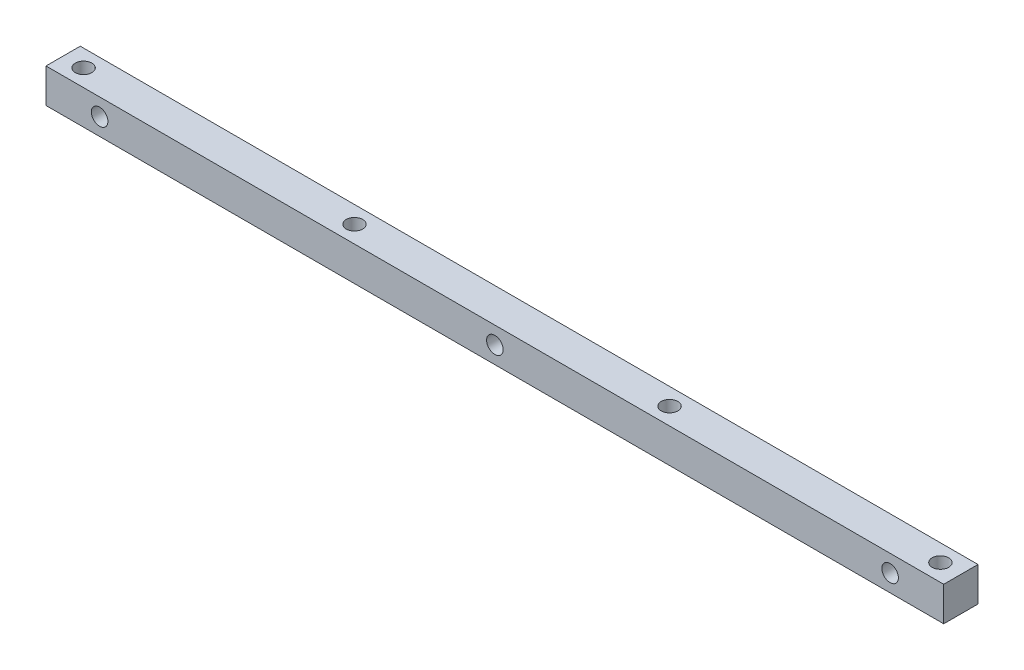
ISO-10303-21;
HEADER;
FILE_DESCRIPTION(('STEP AP214'),'2;1');
FILE_NAME('part.step','',(''),(''),'','','');
FILE_SCHEMA(('AUTOMOTIVE_DESIGN { 1 0 10303 214 1 1 1 1 }'));
ENDSEC;
DATA;
#1=APPLICATION_CONTEXT('core data for automotive mechanical design processes');
#2=APPLICATION_PROTOCOL_DEFINITION('international standard','automotive_design',2000,#1);
#3=PRODUCT_CONTEXT('',#1,'mechanical');
#4=PRODUCT('Part','Part','',(#3));
#5=PRODUCT_RELATED_PRODUCT_CATEGORY('part','',(#4));
#6=PRODUCT_DEFINITION_FORMATION('','',#4);
#7=PRODUCT_DEFINITION_CONTEXT('part definition',#1,'design');
#8=PRODUCT_DEFINITION('design','',#6,#7);
#9=PRODUCT_DEFINITION_SHAPE('','',#8);
#10=(LENGTH_UNIT() NAMED_UNIT(*) SI_UNIT(.MILLI.,.METRE.));
#11=(NAMED_UNIT(*) PLANE_ANGLE_UNIT() SI_UNIT($,.RADIAN.));
#12=(NAMED_UNIT(*) SI_UNIT($,.STERADIAN.) SOLID_ANGLE_UNIT());
#13=UNCERTAINTY_MEASURE_WITH_UNIT(LENGTH_MEASURE(1.E-05),#10,'distance_accuracy_value','');
#14=(GEOMETRIC_REPRESENTATION_CONTEXT(3) GLOBAL_UNCERTAINTY_ASSIGNED_CONTEXT((#13)) GLOBAL_UNIT_ASSIGNED_CONTEXT((#10,
#11,#12)) REPRESENTATION_CONTEXT('',''));
#15=CARTESIAN_POINT('',(0.,0.,0.));
#16=DIRECTION('',(0.,0.,1.));
#17=DIRECTION('',(1.,0.,0.));
#18=AXIS2_PLACEMENT_3D('',#15,#16,#17);
#19=CARTESIAN_POINT('',(-81.2,3.1,6.2));
#20=DIRECTION('',(0.,0.,1.));
#21=DIRECTION('',(1.,0.,0.));
#22=AXIS2_PLACEMENT_3D('',#19,#20,#21);
#23=PLANE('',#22);
#24=CARTESIAN_POINT('',(1.10442548438641E-13,0.,6.2));
#25=DIRECTION('',(0.,0.,1.));
#26=DIRECTION('',(1.,0.,0.));
#27=AXIS2_PLACEMENT_3D('',#24,#25,#26);
#28=CIRCLE('',#27,1.49999999999992);
#29=CARTESIAN_POINT('',(1.50000000000003,0.,6.2));
#30=VERTEX_POINT('',#29);
#31=EDGE_CURVE('E115',#30,#30,#28,.T.);
#32=ORIENTED_EDGE('',*,*,#31,.F.);
#33=EDGE_LOOP('',(#32));
#34=FACE_BOUND('',#33,.T.);
#35=DIRECTION('',(0.,-1.,0.));
#36=VECTOR('',#35,1.);
#37=CARTESIAN_POINT('',(-81.2,-3.1,6.2));
#38=LINE('',#37,#36);
#39=CARTESIAN_POINT('',(-81.2,3.1,6.2));
#40=VERTEX_POINT('',#39);
#41=CARTESIAN_POINT('',(-81.2,-3.1,6.2));
#42=VERTEX_POINT('',#41);
#43=EDGE_CURVE('E85',#40,#42,#38,.T.);
#44=ORIENTED_EDGE('',*,*,#43,.T.);
#45=DIRECTION('',(1.,0.,0.));
#46=VECTOR('',#45,1.);
#47=CARTESIAN_POINT('',(81.2000000000002,-3.09999999999998,6.2));
#48=LINE('',#47,#46);
#49=CARTESIAN_POINT('',(81.2000000000002,-3.09999999999998,6.2));
#50=VERTEX_POINT('',#49);
#51=EDGE_CURVE('E80',#42,#50,#48,.T.);
#52=ORIENTED_EDGE('',*,*,#51,.T.);
#53=DIRECTION('',(0.,1.,0.));
#54=VECTOR('',#53,1.);
#55=CARTESIAN_POINT('',(81.2000000000002,-3.09999999999998,6.2));
#56=LINE('',#55,#54);
#57=CARTESIAN_POINT('',(81.2000000000002,3.09999999999998,6.2));
#58=VERTEX_POINT('',#57);
#59=EDGE_CURVE('E83',#50,#58,#56,.T.);
#60=ORIENTED_EDGE('',*,*,#59,.T.);
#61=DIRECTION('',(-1.,0.,0.));
#62=VECTOR('',#61,1.);
#63=CARTESIAN_POINT('',(81.2000000000002,3.09999999999998,6.2));
#64=LINE('',#63,#62);
#65=EDGE_CURVE('E50',#58,#40,#64,.T.);
#66=ORIENTED_EDGE('',*,*,#65,.T.);
#67=EDGE_LOOP('',(#44,#52,#60,#66));
#68=FACE_BOUND('',#67,.T.);
#69=CARTESIAN_POINT('',(-71.5,0.,6.2));
#70=DIRECTION('',(0.,0.,1.));
#71=DIRECTION('',(1.,0.,0.));
#72=AXIS2_PLACEMENT_3D('',#69,#70,#71);
#73=CIRCLE('',#72,1.5);
#74=CARTESIAN_POINT('',(-70.,0.,6.2));
#75=VERTEX_POINT('',#74);
#76=EDGE_CURVE('E100',#75,#75,#73,.T.);
#77=ORIENTED_EDGE('',*,*,#76,.F.);
#78=EDGE_LOOP('',(#77));
#79=FACE_BOUND('',#78,.T.);
#80=CARTESIAN_POINT('',(71.5000000000002,0.,6.2));
#81=DIRECTION('',(0.,0.,1.));
#82=DIRECTION('',(1.,0.,0.));
#83=AXIS2_PLACEMENT_3D('',#80,#81,#82);
#84=CIRCLE('',#83,1.5);
#85=CARTESIAN_POINT('',(73.0000000000002,0.,6.2));
#86=VERTEX_POINT('',#85);
#87=EDGE_CURVE('E121',#86,#86,#84,.T.);
#88=ORIENTED_EDGE('',*,*,#87,.F.);
#89=EDGE_LOOP('',(#88));
#90=FACE_BOUND('',#89,.T.);
#91=ADVANCED_FACE('F33',(#34,#68,#79,#90),#23,.T.);
#92=CARTESIAN_POINT('',(-81.2,3.1,0.));
#93=DIRECTION('',(0.,0.,1.));
#94=DIRECTION('',(1.,0.,0.));
#95=AXIS2_PLACEMENT_3D('',#92,#93,#94);
#96=PLANE('',#95);
#97=CARTESIAN_POINT('',(1.10442548438641E-13,0.,0.));
#98=DIRECTION('',(0.,0.,1.));
#99=DIRECTION('',(1.,0.,0.));
#100=AXIS2_PLACEMENT_3D('',#97,#98,#99);
#101=CIRCLE('',#100,1.49999999999992);
#102=CARTESIAN_POINT('',(1.50000000000003,0.,0.));
#103=VERTEX_POINT('',#102);
#104=EDGE_CURVE('E118',#103,#103,#101,.T.);
#105=ORIENTED_EDGE('',*,*,#104,.T.);
#106=EDGE_LOOP('',(#105));
#107=FACE_BOUND('',#106,.T.);
#108=DIRECTION('',(0.,-1.,0.));
#109=VECTOR('',#108,1.);
#110=CARTESIAN_POINT('',(-81.2,-3.1,0.));
#111=LINE('',#110,#109);
#112=CARTESIAN_POINT('',(-81.2,3.1,0.));
#113=VERTEX_POINT('',#112);
#114=CARTESIAN_POINT('',(-81.2,-3.1,0.));
#115=VERTEX_POINT('',#114);
#116=EDGE_CURVE('E97',#113,#115,#111,.T.);
#117=ORIENTED_EDGE('',*,*,#116,.F.);
#118=DIRECTION('',(-1.,0.,0.));
#119=VECTOR('',#118,1.);
#120=CARTESIAN_POINT('',(81.2000000000002,3.09999999999998,0.));
#121=LINE('',#120,#119);
#122=CARTESIAN_POINT('',(81.2000000000002,3.09999999999998,0.));
#123=VERTEX_POINT('',#122);
#124=EDGE_CURVE('E73',#123,#113,#121,.T.);
#125=ORIENTED_EDGE('',*,*,#124,.F.);
#126=DIRECTION('',(0.,1.,0.));
#127=VECTOR('',#126,1.);
#128=CARTESIAN_POINT('',(81.2000000000002,-3.09999999999998,0.));
#129=LINE('',#128,#127);
#130=CARTESIAN_POINT('',(81.2000000000002,-3.09999999999998,0.));
#131=VERTEX_POINT('',#130);
#132=EDGE_CURVE('E67',#131,#123,#129,.T.);
#133=ORIENTED_EDGE('',*,*,#132,.F.);
#134=DIRECTION('',(1.,0.,0.));
#135=VECTOR('',#134,1.);
#136=CARTESIAN_POINT('',(81.2000000000002,-3.09999999999998,0.));
#137=LINE('',#136,#135);
#138=EDGE_CURVE('E89',#115,#131,#137,.T.);
#139=ORIENTED_EDGE('',*,*,#138,.F.);
#140=EDGE_LOOP('',(#117,#125,#133,#139));
#141=FACE_BOUND('',#140,.T.);
#142=CARTESIAN_POINT('',(-71.5,0.,0.));
#143=DIRECTION('',(0.,0.,1.));
#144=DIRECTION('',(1.,0.,0.));
#145=AXIS2_PLACEMENT_3D('',#142,#143,#144);
#146=CIRCLE('',#145,1.5);
#147=CARTESIAN_POINT('',(-70.,0.,0.));
#148=VERTEX_POINT('',#147);
#149=EDGE_CURVE('E112',#148,#148,#146,.T.);
#150=ORIENTED_EDGE('',*,*,#149,.T.);
#151=EDGE_LOOP('',(#150));
#152=FACE_BOUND('',#151,.T.);
#153=CARTESIAN_POINT('',(71.5000000000002,0.,0.));
#154=DIRECTION('',(0.,0.,1.));
#155=DIRECTION('',(1.,0.,0.));
#156=AXIS2_PLACEMENT_3D('',#153,#154,#155);
#157=CIRCLE('',#156,1.5);
#158=CARTESIAN_POINT('',(73.0000000000002,0.,0.));
#159=VERTEX_POINT('',#158);
#160=EDGE_CURVE('E124',#159,#159,#157,.T.);
#161=ORIENTED_EDGE('',*,*,#160,.T.);
#162=EDGE_LOOP('',(#161));
#163=FACE_BOUND('',#162,.T.);
#164=ADVANCED_FACE('F108',(#107,#141,#152,#163),#96,.F.);
#165=CARTESIAN_POINT('',(-81.2,-3.1,6.2));
#166=DIRECTION('',(1.,0.,0.));
#167=DIRECTION('',(0.,0.,-1.));
#168=AXIS2_PLACEMENT_3D('',#165,#166,#167);
#169=PLANE('',#168);
#170=ORIENTED_EDGE('',*,*,#116,.T.);
#171=DIRECTION('',(0.,0.,-1.));
#172=VECTOR('',#171,1.);
#173=CARTESIAN_POINT('',(-81.2,-3.1,6.2));
#174=LINE('',#173,#172);
#175=EDGE_CURVE('E11',#42,#115,#174,.T.);
#176=ORIENTED_EDGE('',*,*,#175,.F.);
#177=ORIENTED_EDGE('',*,*,#43,.F.);
#178=DIRECTION('',(0.,0.,-1.));
#179=VECTOR('',#178,1.);
#180=CARTESIAN_POINT('',(-81.2,3.1,6.2));
#181=LINE('',#180,#179);
#182=EDGE_CURVE('E93',#40,#113,#181,.T.);
#183=ORIENTED_EDGE('',*,*,#182,.T.);
#184=EDGE_LOOP('',(#170,#176,#177,#183));
#185=FACE_BOUND('',#184,.T.);
#186=ADVANCED_FACE('F35',(#185),#169,.F.);
#187=CARTESIAN_POINT('',(81.2000000000002,-3.09999999999998,6.2));
#188=DIRECTION('',(0.,1.,0.));
#189=DIRECTION('',(-1.,0.,0.));
#190=AXIS2_PLACEMENT_3D('',#187,#188,#189);
#191=PLANE('',#190);
#192=CARTESIAN_POINT('',(77.5000000000001,-3.10000000000001,3.1));
#193=DIRECTION('',(0.,1.,0.));
#194=DIRECTION('',(0.,0.,1.));
#195=AXIS2_PLACEMENT_3D('',#192,#193,#194);
#196=CIRCLE('',#195,1.5);
#197=CARTESIAN_POINT('',(77.5000000000001,-3.10000000000001,4.6));
#198=VERTEX_POINT('',#197);
#199=EDGE_CURVE('E145',#198,#198,#196,.T.);
#200=ORIENTED_EDGE('',*,*,#199,.T.);
#201=EDGE_LOOP('',(#200));
#202=FACE_BOUND('',#201,.T.);
#203=CARTESIAN_POINT('',(28.5000000000001,-3.10000000000001,3.1));
#204=DIRECTION('',(0.,1.,0.));
#205=DIRECTION('',(0.,0.,1.));
#206=AXIS2_PLACEMENT_3D('',#203,#204,#205);
#207=CIRCLE('',#206,1.5);
#208=CARTESIAN_POINT('',(28.5000000000001,-3.10000000000001,4.6));
#209=VERTEX_POINT('',#208);
#210=EDGE_CURVE('E139',#209,#209,#207,.T.);
#211=ORIENTED_EDGE('',*,*,#210,.T.);
#212=EDGE_LOOP('',(#211));
#213=FACE_BOUND('',#212,.T.);
#214=CARTESIAN_POINT('',(-28.4999999999999,-3.10000000000001,3.1));
#215=DIRECTION('',(0.,1.,0.));
#216=DIRECTION('',(0.,0.,1.));
#217=AXIS2_PLACEMENT_3D('',#214,#215,#216);
#218=CIRCLE('',#217,1.5);
#219=CARTESIAN_POINT('',(-28.4999999999999,-3.10000000000001,4.6));
#220=VERTEX_POINT('',#219);
#221=EDGE_CURVE('E133',#220,#220,#218,.T.);
#222=ORIENTED_EDGE('',*,*,#221,.T.);
#223=EDGE_LOOP('',(#222));
#224=FACE_BOUND('',#223,.T.);
#225=CARTESIAN_POINT('',(-77.4999999999999,-3.10000000000001,3.1));
#226=DIRECTION('',(0.,1.,0.));
#227=DIRECTION('',(0.,0.,1.));
#228=AXIS2_PLACEMENT_3D('',#225,#226,#227);
#229=CIRCLE('',#228,1.5);
#230=CARTESIAN_POINT('',(-77.4999999999999,-3.10000000000001,4.6));
#231=VERTEX_POINT('',#230);
#232=EDGE_CURVE('E127',#231,#231,#229,.T.);
#233=ORIENTED_EDGE('',*,*,#232,.T.);
#234=EDGE_LOOP('',(#233));
#235=FACE_BOUND('',#234,.T.);
#236=ORIENTED_EDGE('',*,*,#138,.T.);
#237=DIRECTION('',(0.,0.,-1.));
#238=VECTOR('',#237,1.);
#239=CARTESIAN_POINT('',(81.2000000000002,-3.09999999999998,6.2));
#240=LINE('',#239,#238);
#241=EDGE_CURVE('E42',#50,#131,#240,.T.);
#242=ORIENTED_EDGE('',*,*,#241,.F.);
#243=ORIENTED_EDGE('',*,*,#51,.F.);
#244=ORIENTED_EDGE('',*,*,#175,.T.);
#245=EDGE_LOOP('',(#236,#242,#243,#244));
#246=FACE_BOUND('',#245,.T.);
#247=ADVANCED_FACE('F88',(#202,#213,#224,#235,#246),#191,.F.);
#248=CARTESIAN_POINT('',(81.2000000000002,-3.09999999999998,6.2));
#249=DIRECTION('',(-1.,0.,0.));
#250=DIRECTION('',(0.,0.,1.));
#251=AXIS2_PLACEMENT_3D('',#248,#249,#250);
#252=PLANE('',#251);
#253=ORIENTED_EDGE('',*,*,#132,.T.);
#254=DIRECTION('',(0.,0.,-1.));
#255=VECTOR('',#254,1.);
#256=CARTESIAN_POINT('',(81.2000000000002,3.09999999999998,6.2));
#257=LINE('',#256,#255);
#258=EDGE_CURVE('E90',#58,#123,#257,.T.);
#259=ORIENTED_EDGE('',*,*,#258,.F.);
#260=ORIENTED_EDGE('',*,*,#59,.F.);
#261=ORIENTED_EDGE('',*,*,#241,.T.);
#262=EDGE_LOOP('',(#253,#259,#260,#261));
#263=FACE_BOUND('',#262,.T.);
#264=ADVANCED_FACE('F91',(#263),#252,.F.);
#265=CARTESIAN_POINT('',(81.2000000000002,3.09999999999998,6.2));
#266=DIRECTION('',(0.,-1.,0.));
#267=DIRECTION('',(1.,0.,0.));
#268=AXIS2_PLACEMENT_3D('',#265,#266,#267);
#269=PLANE('',#268);
#270=CARTESIAN_POINT('',(77.5000000000001,3.09999999999999,3.1));
#271=DIRECTION('',(0.,1.,0.));
#272=DIRECTION('',(0.,0.,1.));
#273=AXIS2_PLACEMENT_3D('',#270,#271,#272);
#274=CIRCLE('',#273,1.5);
#275=CARTESIAN_POINT('',(77.5000000000001,3.09999999999999,4.6));
#276=VERTEX_POINT('',#275);
#277=EDGE_CURVE('E148',#276,#276,#274,.T.);
#278=ORIENTED_EDGE('',*,*,#277,.F.);
#279=EDGE_LOOP('',(#278));
#280=FACE_BOUND('',#279,.T.);
#281=CARTESIAN_POINT('',(28.5000000000001,3.09999999999999,3.1));
#282=DIRECTION('',(0.,1.,0.));
#283=DIRECTION('',(0.,0.,1.));
#284=AXIS2_PLACEMENT_3D('',#281,#282,#283);
#285=CIRCLE('',#284,1.5);
#286=CARTESIAN_POINT('',(28.5000000000001,3.09999999999999,4.6));
#287=VERTEX_POINT('',#286);
#288=EDGE_CURVE('E142',#287,#287,#285,.T.);
#289=ORIENTED_EDGE('',*,*,#288,.F.);
#290=EDGE_LOOP('',(#289));
#291=FACE_BOUND('',#290,.T.);
#292=CARTESIAN_POINT('',(-28.4999999999999,3.09999999999999,3.1));
#293=DIRECTION('',(0.,1.,0.));
#294=DIRECTION('',(0.,0.,1.));
#295=AXIS2_PLACEMENT_3D('',#292,#293,#294);
#296=CIRCLE('',#295,1.5);
#297=CARTESIAN_POINT('',(-28.4999999999999,3.09999999999999,4.6));
#298=VERTEX_POINT('',#297);
#299=EDGE_CURVE('E136',#298,#298,#296,.T.);
#300=ORIENTED_EDGE('',*,*,#299,.F.);
#301=EDGE_LOOP('',(#300));
#302=FACE_BOUND('',#301,.T.);
#303=CARTESIAN_POINT('',(-77.4999999999999,3.09999999999999,3.1));
#304=DIRECTION('',(0.,1.,0.));
#305=DIRECTION('',(0.,0.,1.));
#306=AXIS2_PLACEMENT_3D('',#303,#304,#305);
#307=CIRCLE('',#306,1.5);
#308=CARTESIAN_POINT('',(-77.4999999999999,3.09999999999999,4.6));
#309=VERTEX_POINT('',#308);
#310=EDGE_CURVE('E130',#309,#309,#307,.T.);
#311=ORIENTED_EDGE('',*,*,#310,.F.);
#312=EDGE_LOOP('',(#311));
#313=FACE_BOUND('',#312,.T.);
#314=ORIENTED_EDGE('',*,*,#124,.T.);
#315=ORIENTED_EDGE('',*,*,#182,.F.);
#316=ORIENTED_EDGE('',*,*,#65,.F.);
#317=ORIENTED_EDGE('',*,*,#258,.T.);
#318=EDGE_LOOP('',(#314,#315,#316,#317));
#319=FACE_BOUND('',#318,.T.);
#320=ADVANCED_FACE('F105',(#280,#291,#302,#313,#319),#269,.F.);
#321=CARTESIAN_POINT('',(-71.5,0.,6.2));
#322=DIRECTION('',(0.,0.,-1.));
#323=DIRECTION('',(-1.,0.,0.));
#324=AXIS2_PLACEMENT_3D('',#321,#322,#323);
#325=CYLINDRICAL_SURFACE('',#324,1.5);
#326=ORIENTED_EDGE('',*,*,#76,.T.);
#327=EDGE_LOOP('',(#326));
#328=FACE_BOUND('',#327,.T.);
#329=ORIENTED_EDGE('',*,*,#149,.F.);
#330=EDGE_LOOP('',(#329));
#331=FACE_BOUND('',#330,.T.);
#332=ADVANCED_FACE('F165',(#328,#331),#325,.F.);
#333=CARTESIAN_POINT('',(1.10442548438641E-13,0.,6.2));
#334=DIRECTION('',(0.,0.,-1.));
#335=DIRECTION('',(-1.,0.,0.));
#336=AXIS2_PLACEMENT_3D('',#333,#334,#335);
#337=CYLINDRICAL_SURFACE('',#336,1.49999999999992);
#338=ORIENTED_EDGE('',*,*,#31,.T.);
#339=EDGE_LOOP('',(#338));
#340=FACE_BOUND('',#339,.T.);
#341=ORIENTED_EDGE('',*,*,#104,.F.);
#342=EDGE_LOOP('',(#341));
#343=FACE_BOUND('',#342,.T.);
#344=ADVANCED_FACE('F185',(#340,#343),#337,.F.);
#345=CARTESIAN_POINT('',(71.5000000000002,0.,6.2));
#346=DIRECTION('',(0.,0.,-1.));
#347=DIRECTION('',(-1.,0.,0.));
#348=AXIS2_PLACEMENT_3D('',#345,#346,#347);
#349=CYLINDRICAL_SURFACE('',#348,1.5);
#350=ORIENTED_EDGE('',*,*,#87,.T.);
#351=EDGE_LOOP('',(#350));
#352=FACE_BOUND('',#351,.T.);
#353=ORIENTED_EDGE('',*,*,#160,.F.);
#354=EDGE_LOOP('',(#353));
#355=FACE_BOUND('',#354,.T.);
#356=ADVANCED_FACE('F176',(#352,#355),#349,.F.);
#357=CARTESIAN_POINT('',(-77.4999999999999,-3.10000000000001,3.1));
#358=DIRECTION('',(0.,1.,0.));
#359=DIRECTION('',(0.,0.,1.));
#360=AXIS2_PLACEMENT_3D('',#357,#358,#359);
#361=CYLINDRICAL_SURFACE('',#360,1.5);
#362=ORIENTED_EDGE('',*,*,#232,.F.);
#363=EDGE_LOOP('',(#362));
#364=FACE_BOUND('',#363,.T.);
#365=ORIENTED_EDGE('',*,*,#310,.T.);
#366=EDGE_LOOP('',(#365));
#367=FACE_BOUND('',#366,.T.);
#368=ADVANCED_FACE('F173',(#364,#367),#361,.F.);
#369=CARTESIAN_POINT('',(-28.4999999999999,-3.10000000000001,3.1));
#370=DIRECTION('',(0.,1.,0.));
#371=DIRECTION('',(0.,0.,1.));
#372=AXIS2_PLACEMENT_3D('',#369,#370,#371);
#373=CYLINDRICAL_SURFACE('',#372,1.5);
#374=ORIENTED_EDGE('',*,*,#221,.F.);
#375=EDGE_LOOP('',(#374));
#376=FACE_BOUND('',#375,.T.);
#377=ORIENTED_EDGE('',*,*,#299,.T.);
#378=EDGE_LOOP('',(#377));
#379=FACE_BOUND('',#378,.T.);
#380=ADVANCED_FACE('F175',(#376,#379),#373,.F.);
#381=CARTESIAN_POINT('',(28.5000000000001,-3.10000000000001,3.1));
#382=DIRECTION('',(0.,1.,0.));
#383=DIRECTION('',(0.,0.,1.));
#384=AXIS2_PLACEMENT_3D('',#381,#382,#383);
#385=CYLINDRICAL_SURFACE('',#384,1.5);
#386=ORIENTED_EDGE('',*,*,#210,.F.);
#387=EDGE_LOOP('',(#386));
#388=FACE_BOUND('',#387,.T.);
#389=ORIENTED_EDGE('',*,*,#288,.T.);
#390=EDGE_LOOP('',(#389));
#391=FACE_BOUND('',#390,.T.);
#392=ADVANCED_FACE('F159',(#388,#391),#385,.F.);
#393=CARTESIAN_POINT('',(77.5000000000001,-3.10000000000001,3.1));
#394=DIRECTION('',(0.,1.,0.));
#395=DIRECTION('',(0.,0.,1.));
#396=AXIS2_PLACEMENT_3D('',#393,#394,#395);
#397=CYLINDRICAL_SURFACE('',#396,1.5);
#398=ORIENTED_EDGE('',*,*,#199,.F.);
#399=EDGE_LOOP('',(#398));
#400=FACE_BOUND('',#399,.T.);
#401=ORIENTED_EDGE('',*,*,#277,.T.);
#402=EDGE_LOOP('',(#401));
#403=FACE_BOUND('',#402,.T.);
#404=ADVANCED_FACE('F156',(#400,#403),#397,.F.);
#405=CLOSED_SHELL('',(#91,#164,#186,#247,#264,#320,#332,#344,#356,#368,#380,#392,#404));
#406=MANIFOLD_SOLID_BREP('B2',#405);
#407=ADVANCED_BREP_SHAPE_REPRESENTATION('',(#18,#406),#14);
#408=SHAPE_DEFINITION_REPRESENTATION(#9,#407);
ENDSEC;
END-ISO-10303-21;
